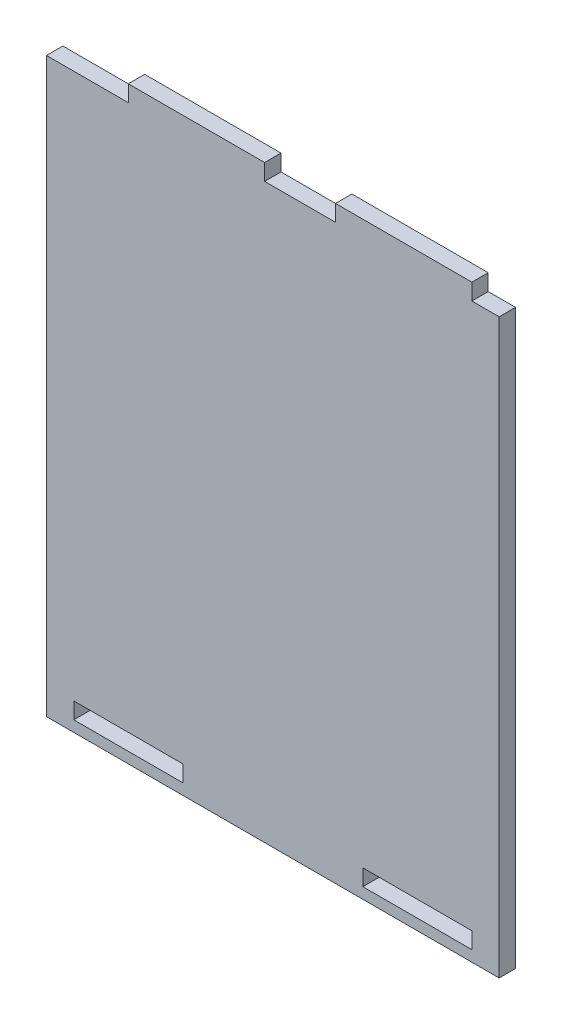
ISO-10303-21;
HEADER;
FILE_DESCRIPTION(('STEP AP214'),'2;1');
FILE_NAME('part.step','',(''),(''),'','','');
FILE_SCHEMA(('AUTOMOTIVE_DESIGN { 1 0 10303 214 1 1 1 1 }'));
ENDSEC;
DATA;
#1=APPLICATION_CONTEXT('core data for automotive mechanical design processes');
#2=APPLICATION_PROTOCOL_DEFINITION('international standard','automotive_design',2000,#1);
#3=PRODUCT_CONTEXT('',#1,'mechanical');
#4=PRODUCT('Part','Part','',(#3));
#5=PRODUCT_RELATED_PRODUCT_CATEGORY('part','',(#4));
#6=PRODUCT_DEFINITION_FORMATION('','',#4);
#7=PRODUCT_DEFINITION_CONTEXT('part definition',#1,'design');
#8=PRODUCT_DEFINITION('design','',#6,#7);
#9=PRODUCT_DEFINITION_SHAPE('','',#8);
#10=(LENGTH_UNIT() NAMED_UNIT(*) SI_UNIT(.MILLI.,.METRE.));
#11=(NAMED_UNIT(*) PLANE_ANGLE_UNIT() SI_UNIT($,.RADIAN.));
#12=(NAMED_UNIT(*) SI_UNIT($,.STERADIAN.) SOLID_ANGLE_UNIT());
#13=UNCERTAINTY_MEASURE_WITH_UNIT(LENGTH_MEASURE(1.E-05),#10,'distance_accuracy_value','');
#14=(GEOMETRIC_REPRESENTATION_CONTEXT(3) GLOBAL_UNCERTAINTY_ASSIGNED_CONTEXT((#13)) GLOBAL_UNIT_ASSIGNED_CONTEXT((#10,
#11,#12)) REPRESENTATION_CONTEXT('',''));
#15=CARTESIAN_POINT('',(0.,0.,0.));
#16=DIRECTION('',(0.,0.,1.));
#17=DIRECTION('',(1.,0.,0.));
#18=AXIS2_PLACEMENT_3D('',#15,#16,#17);
#19=CARTESIAN_POINT('',(-66.5140684926858,-62.4844720496894,3.));
#20=DIRECTION('',(1.,0.,0.));
#21=DIRECTION('',(0.,0.,-1.));
#22=AXIS2_PLACEMENT_3D('',#19,#20,#21);
#23=PLANE('',#22);
#24=DIRECTION('',(0.,-1.,0.));
#25=VECTOR('',#24,1.);
#26=CARTESIAN_POINT('',(-66.5140684926858,-62.4844720496894,0.));
#27=LINE('',#26,#25);
#28=CARTESIAN_POINT('',(-66.5140684926858,42.5155279503106,0.));
#29=VERTEX_POINT('',#28);
#30=CARTESIAN_POINT('',(-66.5140684926858,-62.4844720496894,0.));
#31=VERTEX_POINT('',#30);
#32=EDGE_CURVE('E231',#29,#31,#27,.T.);
#33=ORIENTED_EDGE('',*,*,#32,.T.);
#34=DIRECTION('',(0.,0.,-1.));
#35=VECTOR('',#34,1.);
#36=CARTESIAN_POINT('',(-66.5140684926858,-62.4844720496894,3.));
#37=LINE('',#36,#35);
#38=CARTESIAN_POINT('',(-66.5140684926858,-62.4844720496894,3.));
#39=VERTEX_POINT('',#38);
#40=EDGE_CURVE('E11',#39,#31,#37,.T.);
#41=ORIENTED_EDGE('',*,*,#40,.F.);
#42=DIRECTION('',(0.,-1.,0.));
#43=VECTOR('',#42,1.);
#44=CARTESIAN_POINT('',(-66.5140684926858,-62.4844720496894,3.));
#45=LINE('',#44,#43);
#46=CARTESIAN_POINT('',(-66.5140684926858,42.5155279503106,3.));
#47=VERTEX_POINT('',#46);
#48=EDGE_CURVE('E238',#47,#39,#45,.T.);
#49=ORIENTED_EDGE('',*,*,#48,.F.);
#50=DIRECTION('',(0.,0.,-1.));
#51=VECTOR('',#50,1.);
#52=CARTESIAN_POINT('',(-66.5140684926858,42.5155279503106,3.));
#53=LINE('',#52,#51);
#54=EDGE_CURVE('E264',#47,#29,#53,.T.);
#55=ORIENTED_EDGE('',*,*,#54,.T.);
#56=EDGE_LOOP('',(#33,#41,#49,#55));
#57=FACE_BOUND('',#56,.T.);
#58=ADVANCED_FACE('F33',(#57),#23,.F.);
#59=CARTESIAN_POINT('',(-66.5140684926858,-62.4844720496894,3.));
#60=DIRECTION('',(0.,1.,0.));
#61=DIRECTION('',(0.,0.,1.));
#62=AXIS2_PLACEMENT_3D('',#59,#60,#61);
#63=PLANE('',#62);
#64=DIRECTION('',(1.,0.,0.));
#65=VECTOR('',#64,1.);
#66=CARTESIAN_POINT('',(-66.5140684926858,-62.4844720496894,0.));
#67=LINE('',#66,#65);
#68=CARTESIAN_POINT('',(16.4859315073142,-62.4844720496894,0.));
#69=VERTEX_POINT('',#68);
#70=EDGE_CURVE('E267',#31,#69,#67,.T.);
#71=ORIENTED_EDGE('',*,*,#70,.T.);
#72=DIRECTION('',(0.,0.,-1.));
#73=VECTOR('',#72,1.);
#74=CARTESIAN_POINT('',(16.4859315073142,-62.4844720496894,3.));
#75=LINE('',#74,#73);
#76=CARTESIAN_POINT('',(16.4859315073142,-62.4844720496894,3.));
#77=VERTEX_POINT('',#76);
#78=EDGE_CURVE('E40',#77,#69,#75,.T.);
#79=ORIENTED_EDGE('',*,*,#78,.F.);
#80=DIRECTION('',(1.,0.,0.));
#81=VECTOR('',#80,1.);
#82=CARTESIAN_POINT('',(-66.5140684926858,-62.4844720496894,3.));
#83=LINE('',#82,#81);
#84=EDGE_CURVE('E241',#39,#77,#83,.T.);
#85=ORIENTED_EDGE('',*,*,#84,.F.);
#86=ORIENTED_EDGE('',*,*,#40,.T.);
#87=EDGE_LOOP('',(#71,#79,#85,#86));
#88=FACE_BOUND('',#87,.T.);
#89=ADVANCED_FACE('F343',(#88),#63,.F.);
#90=CARTESIAN_POINT('',(16.4859315073142,-62.4844720496894,3.));
#91=DIRECTION('',(-1.,0.,0.));
#92=DIRECTION('',(0.,-1.,0.));
#93=AXIS2_PLACEMENT_3D('',#90,#91,#92);
#94=PLANE('',#93);
#95=DIRECTION('',(0.,1.,0.));
#96=VECTOR('',#95,1.);
#97=CARTESIAN_POINT('',(16.4859315073142,-62.4844720496894,0.));
#98=LINE('',#97,#96);
#99=CARTESIAN_POINT('',(16.4859315073142,42.5155279503106,0.));
#100=VERTEX_POINT('',#99);
#101=EDGE_CURVE('E269',#69,#100,#98,.T.);
#102=ORIENTED_EDGE('',*,*,#101,.T.);
#103=DIRECTION('',(0.,0.,-1.));
#104=VECTOR('',#103,1.);
#105=CARTESIAN_POINT('',(16.4859315073142,42.5155279503106,3.));
#106=LINE('',#105,#104);
#107=CARTESIAN_POINT('',(16.4859315073142,42.5155279503106,3.));
#108=VERTEX_POINT('',#107);
#109=EDGE_CURVE('E314',#108,#100,#106,.T.);
#110=ORIENTED_EDGE('',*,*,#109,.F.);
#111=DIRECTION('',(0.,1.,0.));
#112=VECTOR('',#111,1.);
#113=CARTESIAN_POINT('',(16.4859315073142,-62.4844720496894,3.));
#114=LINE('',#113,#112);
#115=EDGE_CURVE('E244',#77,#108,#114,.T.);
#116=ORIENTED_EDGE('',*,*,#115,.F.);
#117=ORIENTED_EDGE('',*,*,#78,.T.);
#118=EDGE_LOOP('',(#102,#110,#116,#117));
#119=FACE_BOUND('',#118,.T.);
#120=ADVANCED_FACE('F321',(#119),#94,.F.);
#121=CARTESIAN_POINT('',(11.4859315073142,42.5155279503106,3.));
#122=DIRECTION('',(0.,-1.,0.));
#123=DIRECTION('',(1.,0.,0.));
#124=AXIS2_PLACEMENT_3D('',#121,#122,#123);
#125=PLANE('',#124);
#126=DIRECTION('',(-1.,0.,0.));
#127=VECTOR('',#126,1.);
#128=CARTESIAN_POINT('',(11.4859315073142,42.5155279503106,0.));
#129=LINE('',#128,#127);
#130=CARTESIAN_POINT('',(11.4859315073142,42.5155279503106,0.));
#131=VERTEX_POINT('',#130);
#132=EDGE_CURVE('E271',#100,#131,#129,.T.);
#133=ORIENTED_EDGE('',*,*,#132,.T.);
#134=DIRECTION('',(0.,0.,-1.));
#135=VECTOR('',#134,1.);
#136=CARTESIAN_POINT('',(11.4859315073142,42.5155279503106,3.));
#137=LINE('',#136,#135);
#138=CARTESIAN_POINT('',(11.4859315073142,42.5155279503106,3.));
#139=VERTEX_POINT('',#138);
#140=EDGE_CURVE('E311',#139,#131,#137,.T.);
#141=ORIENTED_EDGE('',*,*,#140,.F.);
#142=DIRECTION('',(-1.,0.,0.));
#143=VECTOR('',#142,1.);
#144=CARTESIAN_POINT('',(11.4859315073142,42.5155279503106,3.));
#145=LINE('',#144,#143);
#146=EDGE_CURVE('E246',#108,#139,#145,.T.);
#147=ORIENTED_EDGE('',*,*,#146,.F.);
#148=ORIENTED_EDGE('',*,*,#109,.T.);
#149=EDGE_LOOP('',(#133,#141,#147,#148));
#150=FACE_BOUND('',#149,.T.);
#151=ADVANCED_FACE('F332',(#150),#125,.F.);
#152=CARTESIAN_POINT('',(11.4859315073142,42.5155279503106,3.));
#153=DIRECTION('',(-1.,0.,0.));
#154=DIRECTION('',(0.,0.,1.));
#155=AXIS2_PLACEMENT_3D('',#152,#153,#154);
#156=PLANE('',#155);
#157=DIRECTION('',(0.,1.,0.));
#158=VECTOR('',#157,1.);
#159=CARTESIAN_POINT('',(11.4859315073142,42.5155279503106,0.));
#160=LINE('',#159,#158);
#161=CARTESIAN_POINT('',(11.4859315073142,45.5155279503106,0.));
#162=VERTEX_POINT('',#161);
#163=EDGE_CURVE('E273',#131,#162,#160,.T.);
#164=ORIENTED_EDGE('',*,*,#163,.T.);
#165=DIRECTION('',(0.,0.,-1.));
#166=VECTOR('',#165,1.);
#167=CARTESIAN_POINT('',(11.4859315073142,45.5155279503106,3.));
#168=LINE('',#167,#166);
#169=CARTESIAN_POINT('',(11.4859315073142,45.5155279503106,3.));
#170=VERTEX_POINT('',#169);
#171=EDGE_CURVE('E308',#170,#162,#168,.T.);
#172=ORIENTED_EDGE('',*,*,#171,.F.);
#173=DIRECTION('',(0.,1.,0.));
#174=VECTOR('',#173,1.);
#175=CARTESIAN_POINT('',(11.4859315073142,42.5155279503106,3.));
#176=LINE('',#175,#174);
#177=EDGE_CURVE('E248',#139,#170,#176,.T.);
#178=ORIENTED_EDGE('',*,*,#177,.F.);
#179=ORIENTED_EDGE('',*,*,#140,.T.);
#180=EDGE_LOOP('',(#164,#172,#178,#179));
#181=FACE_BOUND('',#180,.T.);
#182=ADVANCED_FACE('F336',(#181),#156,.F.);
#183=CARTESIAN_POINT('',(-13.5140684926858,45.5155279503106,3.));
#184=DIRECTION('',(0.,-1.,0.));
#185=DIRECTION('',(0.,0.,-1.));
#186=AXIS2_PLACEMENT_3D('',#183,#184,#185);
#187=PLANE('',#186);
#188=DIRECTION('',(-1.,0.,0.));
#189=VECTOR('',#188,1.);
#190=CARTESIAN_POINT('',(-13.5140684926858,45.5155279503106,0.));
#191=LINE('',#190,#189);
#192=CARTESIAN_POINT('',(-13.5140684926858,45.5155279503106,0.));
#193=VERTEX_POINT('',#192);
#194=EDGE_CURVE('E275',#162,#193,#191,.T.);
#195=ORIENTED_EDGE('',*,*,#194,.T.);
#196=DIRECTION('',(0.,0.,-1.));
#197=VECTOR('',#196,1.);
#198=CARTESIAN_POINT('',(-13.5140684926858,45.5155279503106,3.));
#199=LINE('',#198,#197);
#200=CARTESIAN_POINT('',(-13.5140684926858,45.5155279503106,3.));
#201=VERTEX_POINT('',#200);
#202=EDGE_CURVE('E305',#201,#193,#199,.T.);
#203=ORIENTED_EDGE('',*,*,#202,.F.);
#204=DIRECTION('',(-1.,0.,0.));
#205=VECTOR('',#204,1.);
#206=CARTESIAN_POINT('',(-13.5140684926858,45.5155279503106,3.));
#207=LINE('',#206,#205);
#208=EDGE_CURVE('E250',#170,#201,#207,.T.);
#209=ORIENTED_EDGE('',*,*,#208,.F.);
#210=ORIENTED_EDGE('',*,*,#171,.T.);
#211=EDGE_LOOP('',(#195,#203,#209,#210));
#212=FACE_BOUND('',#211,.T.);
#213=ADVANCED_FACE('F376',(#212),#187,.F.);
#214=CARTESIAN_POINT('',(-13.5140684926858,42.5155279503106,3.));
#215=DIRECTION('',(1.,0.,0.));
#216=DIRECTION('',(0.,0.,-1.));
#217=AXIS2_PLACEMENT_3D('',#214,#215,#216);
#218=PLANE('',#217);
#219=DIRECTION('',(0.,-1.,0.));
#220=VECTOR('',#219,1.);
#221=CARTESIAN_POINT('',(-13.5140684926858,42.5155279503106,0.));
#222=LINE('',#221,#220);
#223=CARTESIAN_POINT('',(-13.5140684926858,42.5155279503106,0.));
#224=VERTEX_POINT('',#223);
#225=EDGE_CURVE('E277',#193,#224,#222,.T.);
#226=ORIENTED_EDGE('',*,*,#225,.T.);
#227=DIRECTION('',(0.,0.,-1.));
#228=VECTOR('',#227,1.);
#229=CARTESIAN_POINT('',(-13.5140684926858,42.5155279503106,3.));
#230=LINE('',#229,#228);
#231=CARTESIAN_POINT('',(-13.5140684926858,42.5155279503106,3.));
#232=VERTEX_POINT('',#231);
#233=EDGE_CURVE('E302',#232,#224,#230,.T.);
#234=ORIENTED_EDGE('',*,*,#233,.F.);
#235=DIRECTION('',(0.,-1.,0.));
#236=VECTOR('',#235,1.);
#237=CARTESIAN_POINT('',(-13.5140684926858,42.5155279503106,3.));
#238=LINE('',#237,#236);
#239=EDGE_CURVE('E252',#201,#232,#238,.T.);
#240=ORIENTED_EDGE('',*,*,#239,.F.);
#241=ORIENTED_EDGE('',*,*,#202,.T.);
#242=EDGE_LOOP('',(#226,#234,#240,#241));
#243=FACE_BOUND('',#242,.T.);
#244=ADVANCED_FACE('F374',(#243),#218,.F.);
#245=CARTESIAN_POINT('',(-26.5140684926858,42.5155279503106,3.));
#246=DIRECTION('',(0.,-1.,0.));
#247=DIRECTION('',(0.,0.,-1.));
#248=AXIS2_PLACEMENT_3D('',#245,#246,#247);
#249=PLANE('',#248);
#250=DIRECTION('',(-1.,0.,0.));
#251=VECTOR('',#250,1.);
#252=CARTESIAN_POINT('',(-26.5140684926858,42.5155279503106,0.));
#253=LINE('',#252,#251);
#254=CARTESIAN_POINT('',(-26.5140684926858,42.5155279503106,0.));
#255=VERTEX_POINT('',#254);
#256=EDGE_CURVE('E279',#224,#255,#253,.T.);
#257=ORIENTED_EDGE('',*,*,#256,.T.);
#258=DIRECTION('',(0.,0.,-1.));
#259=VECTOR('',#258,1.);
#260=CARTESIAN_POINT('',(-26.5140684926858,42.5155279503106,3.));
#261=LINE('',#260,#259);
#262=CARTESIAN_POINT('',(-26.5140684926858,42.5155279503106,3.));
#263=VERTEX_POINT('',#262);
#264=EDGE_CURVE('E299',#263,#255,#261,.T.);
#265=ORIENTED_EDGE('',*,*,#264,.F.);
#266=DIRECTION('',(-1.,0.,0.));
#267=VECTOR('',#266,1.);
#268=CARTESIAN_POINT('',(-26.5140684926858,42.5155279503106,3.));
#269=LINE('',#268,#267);
#270=EDGE_CURVE('E254',#232,#263,#269,.T.);
#271=ORIENTED_EDGE('',*,*,#270,.F.);
#272=ORIENTED_EDGE('',*,*,#233,.T.);
#273=EDGE_LOOP('',(#257,#265,#271,#272));
#274=FACE_BOUND('',#273,.T.);
#275=ADVANCED_FACE('F370',(#274),#249,.F.);
#276=CARTESIAN_POINT('',(-26.5140684926858,42.5155279503106,3.));
#277=DIRECTION('',(-1.,0.,0.));
#278=DIRECTION('',(0.,0.,1.));
#279=AXIS2_PLACEMENT_3D('',#276,#277,#278);
#280=PLANE('',#279);
#281=DIRECTION('',(0.,1.,0.));
#282=VECTOR('',#281,1.);
#283=CARTESIAN_POINT('',(-26.5140684926858,42.5155279503106,0.));
#284=LINE('',#283,#282);
#285=CARTESIAN_POINT('',(-26.5140684926858,45.5155279503106,0.));
#286=VERTEX_POINT('',#285);
#287=EDGE_CURVE('E281',#255,#286,#284,.T.);
#288=ORIENTED_EDGE('',*,*,#287,.T.);
#289=DIRECTION('',(0.,0.,-1.));
#290=VECTOR('',#289,1.);
#291=CARTESIAN_POINT('',(-26.5140684926858,45.5155279503106,3.));
#292=LINE('',#291,#290);
#293=CARTESIAN_POINT('',(-26.5140684926858,45.5155279503106,3.));
#294=VERTEX_POINT('',#293);
#295=EDGE_CURVE('E296',#294,#286,#292,.T.);
#296=ORIENTED_EDGE('',*,*,#295,.F.);
#297=DIRECTION('',(0.,1.,0.));
#298=VECTOR('',#297,1.);
#299=CARTESIAN_POINT('',(-26.5140684926858,42.5155279503106,3.));
#300=LINE('',#299,#298);
#301=EDGE_CURVE('E256',#263,#294,#300,.T.);
#302=ORIENTED_EDGE('',*,*,#301,.F.);
#303=ORIENTED_EDGE('',*,*,#264,.T.);
#304=EDGE_LOOP('',(#288,#296,#302,#303));
#305=FACE_BOUND('',#304,.T.);
#306=ADVANCED_FACE('F365',(#305),#280,.F.);
#307=CARTESIAN_POINT('',(-51.5140684926858,45.5155279503106,3.));
#308=DIRECTION('',(0.,-1.,0.));
#309=DIRECTION('',(0.,0.,-1.));
#310=AXIS2_PLACEMENT_3D('',#307,#308,#309);
#311=PLANE('',#310);
#312=DIRECTION('',(-1.,0.,0.));
#313=VECTOR('',#312,1.);
#314=CARTESIAN_POINT('',(-51.5140684926858,45.5155279503106,0.));
#315=LINE('',#314,#313);
#316=CARTESIAN_POINT('',(-51.5140684926858,45.5155279503106,0.));
#317=VERTEX_POINT('',#316);
#318=EDGE_CURVE('E283',#286,#317,#315,.T.);
#319=ORIENTED_EDGE('',*,*,#318,.T.);
#320=DIRECTION('',(0.,0.,-1.));
#321=VECTOR('',#320,1.);
#322=CARTESIAN_POINT('',(-51.5140684926858,45.5155279503106,3.));
#323=LINE('',#322,#321);
#324=CARTESIAN_POINT('',(-51.5140684926858,45.5155279503106,3.));
#325=VERTEX_POINT('',#324);
#326=EDGE_CURVE('E293',#325,#317,#323,.T.);
#327=ORIENTED_EDGE('',*,*,#326,.F.);
#328=DIRECTION('',(-1.,0.,0.));
#329=VECTOR('',#328,1.);
#330=CARTESIAN_POINT('',(-51.5140684926858,45.5155279503106,3.));
#331=LINE('',#330,#329);
#332=EDGE_CURVE('E258',#294,#325,#331,.T.);
#333=ORIENTED_EDGE('',*,*,#332,.F.);
#334=ORIENTED_EDGE('',*,*,#295,.T.);
#335=EDGE_LOOP('',(#319,#327,#333,#334));
#336=FACE_BOUND('',#335,.T.);
#337=ADVANCED_FACE('F359',(#336),#311,.F.);
#338=CARTESIAN_POINT('',(-51.5140684926858,42.5155279503106,3.));
#339=DIRECTION('',(1.,0.,0.));
#340=DIRECTION('',(0.,0.,-1.));
#341=AXIS2_PLACEMENT_3D('',#338,#339,#340);
#342=PLANE('',#341);
#343=DIRECTION('',(0.,-1.,0.));
#344=VECTOR('',#343,1.);
#345=CARTESIAN_POINT('',(-51.5140684926858,42.5155279503106,0.));
#346=LINE('',#345,#344);
#347=CARTESIAN_POINT('',(-51.5140684926858,42.5155279503106,0.));
#348=VERTEX_POINT('',#347);
#349=EDGE_CURVE('E285',#317,#348,#346,.T.);
#350=ORIENTED_EDGE('',*,*,#349,.T.);
#351=DIRECTION('',(0.,0.,-1.));
#352=VECTOR('',#351,1.);
#353=CARTESIAN_POINT('',(-51.5140684926858,42.5155279503106,3.));
#354=LINE('',#353,#352);
#355=CARTESIAN_POINT('',(-51.5140684926858,42.5155279503106,3.));
#356=VERTEX_POINT('',#355);
#357=EDGE_CURVE('E290',#356,#348,#354,.T.);
#358=ORIENTED_EDGE('',*,*,#357,.F.);
#359=DIRECTION('',(0.,-1.,0.));
#360=VECTOR('',#359,1.);
#361=CARTESIAN_POINT('',(-51.5140684926858,42.5155279503106,3.));
#362=LINE('',#361,#360);
#363=EDGE_CURVE('E260',#325,#356,#362,.T.);
#364=ORIENTED_EDGE('',*,*,#363,.F.);
#365=ORIENTED_EDGE('',*,*,#326,.T.);
#366=EDGE_LOOP('',(#350,#358,#364,#365));
#367=FACE_BOUND('',#366,.T.);
#368=ADVANCED_FACE('F355',(#367),#342,.F.);
#369=CARTESIAN_POINT('',(-66.5140684926858,42.5155279503106,3.));
#370=DIRECTION('',(0.,-1.,0.));
#371=DIRECTION('',(1.,0.,0.));
#372=AXIS2_PLACEMENT_3D('',#369,#370,#371);
#373=PLANE('',#372);
#374=DIRECTION('',(-1.,0.,0.));
#375=VECTOR('',#374,1.);
#376=CARTESIAN_POINT('',(-66.5140684926858,42.5155279503106,0.));
#377=LINE('',#376,#375);
#378=EDGE_CURVE('E242',#348,#29,#377,.T.);
#379=ORIENTED_EDGE('',*,*,#378,.T.);
#380=ORIENTED_EDGE('',*,*,#54,.F.);
#381=DIRECTION('',(-1.,0.,0.));
#382=VECTOR('',#381,1.);
#383=CARTESIAN_POINT('',(-66.5140684926858,42.5155279503106,3.));
#384=LINE('',#383,#382);
#385=EDGE_CURVE('E262',#356,#47,#384,.T.);
#386=ORIENTED_EDGE('',*,*,#385,.F.);
#387=ORIENTED_EDGE('',*,*,#357,.T.);
#388=EDGE_LOOP('',(#379,#380,#386,#387));
#389=FACE_BOUND('',#388,.T.);
#390=ADVANCED_FACE('F350',(#389),#373,.F.);
#391=CARTESIAN_POINT('',(0.,0.,3.));
#392=DIRECTION('',(0.,0.,-1.));
#393=DIRECTION('',(-1.,0.,0.));
#394=AXIS2_PLACEMENT_3D('',#391,#392,#393);
#395=PLANE('',#394);
#396=DIRECTION('',(-1.,0.,0.));
#397=VECTOR('',#396,1.);
#398=CARTESIAN_POINT('',(-8.51406849268578,-60.4844720496894,3.));
#399=LINE('',#398,#397);
#400=CARTESIAN_POINT('',(11.4859315073142,-60.4844720496894,3.));
#401=VERTEX_POINT('',#400);
#402=CARTESIAN_POINT('',(-8.51406849268578,-60.4844720496894,3.));
#403=VERTEX_POINT('',#402);
#404=EDGE_CURVE('E177',#401,#403,#399,.T.);
#405=ORIENTED_EDGE('',*,*,#404,.T.);
#406=DIRECTION('',(0.,1.,0.));
#407=VECTOR('',#406,1.);
#408=CARTESIAN_POINT('',(-8.51406849268578,-57.4844720496894,3.));
#409=LINE('',#408,#407);
#410=CARTESIAN_POINT('',(-8.51406849268578,-57.4844720496894,3.));
#411=VERTEX_POINT('',#410);
#412=EDGE_CURVE('E171',#403,#411,#409,.T.);
#413=ORIENTED_EDGE('',*,*,#412,.T.);
#414=DIRECTION('',(1.,0.,0.));
#415=VECTOR('',#414,1.);
#416=CARTESIAN_POINT('',(-8.51406849268578,-57.4844720496894,3.));
#417=LINE('',#416,#415);
#418=CARTESIAN_POINT('',(11.4859315073142,-57.4844720496894,3.));
#419=VERTEX_POINT('',#418);
#420=EDGE_CURVE('E180',#411,#419,#417,.T.);
#421=ORIENTED_EDGE('',*,*,#420,.T.);
#422=DIRECTION('',(0.,-1.,0.));
#423=VECTOR('',#422,1.);
#424=CARTESIAN_POINT('',(11.4859315073142,-57.4844720496894,3.));
#425=LINE('',#424,#423);
#426=EDGE_CURVE('E47',#419,#401,#425,.T.);
#427=ORIENTED_EDGE('',*,*,#426,.T.);
#428=EDGE_LOOP('',(#405,#413,#421,#427));
#429=FACE_BOUND('',#428,.T.);
#430=DIRECTION('',(-1.,0.,0.));
#431=VECTOR('',#430,1.);
#432=CARTESIAN_POINT('',(-61.5140684926858,-60.4844720496894,3.));
#433=LINE('',#432,#431);
#434=CARTESIAN_POINT('',(-41.5140684926858,-60.4844720496894,3.));
#435=VERTEX_POINT('',#434);
#436=CARTESIAN_POINT('',(-61.5140684926858,-60.4844720496894,3.));
#437=VERTEX_POINT('',#436);
#438=EDGE_CURVE('E216',#435,#437,#433,.T.);
#439=ORIENTED_EDGE('',*,*,#438,.T.);
#440=DIRECTION('',(0.,1.,0.));
#441=VECTOR('',#440,1.);
#442=CARTESIAN_POINT('',(-61.5140684926858,-57.4844720496894,3.));
#443=LINE('',#442,#441);
#444=CARTESIAN_POINT('',(-61.5140684926858,-57.4844720496894,3.));
#445=VERTEX_POINT('',#444);
#446=EDGE_CURVE('E206',#437,#445,#443,.T.);
#447=ORIENTED_EDGE('',*,*,#446,.T.);
#448=DIRECTION('',(1.,0.,0.));
#449=VECTOR('',#448,1.);
#450=CARTESIAN_POINT('',(-61.5140684926858,-57.4844720496894,3.));
#451=LINE('',#450,#449);
#452=CARTESIAN_POINT('',(-41.5140684926858,-57.4844720496894,3.));
#453=VERTEX_POINT('',#452);
#454=EDGE_CURVE('E209',#445,#453,#451,.T.);
#455=ORIENTED_EDGE('',*,*,#454,.T.);
#456=DIRECTION('',(0.,-1.,0.));
#457=VECTOR('',#456,1.);
#458=CARTESIAN_POINT('',(-41.5140684926858,-57.4844720496894,3.));
#459=LINE('',#458,#457);
#460=EDGE_CURVE('E213',#453,#435,#459,.T.);
#461=ORIENTED_EDGE('',*,*,#460,.T.);
#462=EDGE_LOOP('',(#439,#447,#455,#461));
#463=FACE_BOUND('',#462,.T.);
#464=ORIENTED_EDGE('',*,*,#48,.T.);
#465=ORIENTED_EDGE('',*,*,#84,.T.);
#466=ORIENTED_EDGE('',*,*,#115,.T.);
#467=ORIENTED_EDGE('',*,*,#146,.T.);
#468=ORIENTED_EDGE('',*,*,#177,.T.);
#469=ORIENTED_EDGE('',*,*,#208,.T.);
#470=ORIENTED_EDGE('',*,*,#239,.T.);
#471=ORIENTED_EDGE('',*,*,#270,.T.);
#472=ORIENTED_EDGE('',*,*,#301,.T.);
#473=ORIENTED_EDGE('',*,*,#332,.T.);
#474=ORIENTED_EDGE('',*,*,#363,.T.);
#475=ORIENTED_EDGE('',*,*,#385,.T.);
#476=EDGE_LOOP('',(#464,#465,#466,#467,#468,#469,#470,#471,#472,#473,#474,#475));
#477=FACE_BOUND('',#476,.T.);
#478=ADVANCED_FACE('F184',(#429,#463,#477),#395,.F.);
#479=CARTESIAN_POINT('',(0.,0.,0.));
#480=DIRECTION('',(0.,0.,-1.));
#481=DIRECTION('',(-1.,0.,0.));
#482=AXIS2_PLACEMENT_3D('',#479,#480,#481);
#483=PLANE('',#482);
#484=DIRECTION('',(0.,1.,0.));
#485=VECTOR('',#484,1.);
#486=CARTESIAN_POINT('',(-8.51406849268578,-57.4844720496894,0.));
#487=LINE('',#486,#485);
#488=CARTESIAN_POINT('',(-8.51406849268578,-60.4844720496894,0.));
#489=VERTEX_POINT('',#488);
#490=CARTESIAN_POINT('',(-8.51406849268578,-57.4844720496894,0.));
#491=VERTEX_POINT('',#490);
#492=EDGE_CURVE('E55',#489,#491,#487,.T.);
#493=ORIENTED_EDGE('',*,*,#492,.F.);
#494=DIRECTION('',(-1.,0.,0.));
#495=VECTOR('',#494,1.);
#496=CARTESIAN_POINT('',(-8.51406849268578,-60.4844720496894,0.));
#497=LINE('',#496,#495);
#498=CARTESIAN_POINT('',(11.4859315073142,-60.4844720496894,0.));
#499=VERTEX_POINT('',#498);
#500=EDGE_CURVE('E187',#499,#489,#497,.T.);
#501=ORIENTED_EDGE('',*,*,#500,.F.);
#502=DIRECTION('',(0.,-1.,0.));
#503=VECTOR('',#502,1.);
#504=CARTESIAN_POINT('',(11.4859315073142,-57.4844720496894,0.));
#505=LINE('',#504,#503);
#506=CARTESIAN_POINT('',(11.4859315073142,-57.4844720496894,0.));
#507=VERTEX_POINT('',#506);
#508=EDGE_CURVE('E190',#507,#499,#505,.T.);
#509=ORIENTED_EDGE('',*,*,#508,.F.);
#510=DIRECTION('',(1.,0.,0.));
#511=VECTOR('',#510,1.);
#512=CARTESIAN_POINT('',(-8.51406849268578,-57.4844720496894,0.));
#513=LINE('',#512,#511);
#514=EDGE_CURVE('E196',#491,#507,#513,.T.);
#515=ORIENTED_EDGE('',*,*,#514,.F.);
#516=EDGE_LOOP('',(#493,#501,#509,#515));
#517=FACE_BOUND('',#516,.T.);
#518=DIRECTION('',(0.,1.,0.));
#519=VECTOR('',#518,1.);
#520=CARTESIAN_POINT('',(-61.5140684926858,-57.4844720496894,0.));
#521=LINE('',#520,#519);
#522=CARTESIAN_POINT('',(-61.5140684926858,-60.4844720496894,0.));
#523=VERTEX_POINT('',#522);
#524=CARTESIAN_POINT('',(-61.5140684926858,-57.4844720496894,0.));
#525=VERTEX_POINT('',#524);
#526=EDGE_CURVE('E202',#523,#525,#521,.T.);
#527=ORIENTED_EDGE('',*,*,#526,.F.);
#528=DIRECTION('',(-1.,0.,0.));
#529=VECTOR('',#528,1.);
#530=CARTESIAN_POINT('',(-61.5140684926858,-60.4844720496894,0.));
#531=LINE('',#530,#529);
#532=CARTESIAN_POINT('',(-41.5140684926858,-60.4844720496894,0.));
#533=VERTEX_POINT('',#532);
#534=EDGE_CURVE('E210',#533,#523,#531,.T.);
#535=ORIENTED_EDGE('',*,*,#534,.F.);
#536=DIRECTION('',(0.,-1.,0.));
#537=VECTOR('',#536,1.);
#538=CARTESIAN_POINT('',(-41.5140684926858,-57.4844720496894,0.));
#539=LINE('',#538,#537);
#540=CARTESIAN_POINT('',(-41.5140684926858,-57.4844720496894,0.));
#541=VERTEX_POINT('',#540);
#542=EDGE_CURVE('E224',#541,#533,#539,.T.);
#543=ORIENTED_EDGE('',*,*,#542,.F.);
#544=DIRECTION('',(1.,0.,0.));
#545=VECTOR('',#544,1.);
#546=CARTESIAN_POINT('',(-61.5140684926858,-57.4844720496894,0.));
#547=LINE('',#546,#545);
#548=EDGE_CURVE('E221',#525,#541,#547,.T.);
#549=ORIENTED_EDGE('',*,*,#548,.F.);
#550=EDGE_LOOP('',(#527,#535,#543,#549));
#551=FACE_BOUND('',#550,.T.);
#552=ORIENTED_EDGE('',*,*,#32,.F.);
#553=ORIENTED_EDGE('',*,*,#378,.F.);
#554=ORIENTED_EDGE('',*,*,#349,.F.);
#555=ORIENTED_EDGE('',*,*,#318,.F.);
#556=ORIENTED_EDGE('',*,*,#287,.F.);
#557=ORIENTED_EDGE('',*,*,#256,.F.);
#558=ORIENTED_EDGE('',*,*,#225,.F.);
#559=ORIENTED_EDGE('',*,*,#194,.F.);
#560=ORIENTED_EDGE('',*,*,#163,.F.);
#561=ORIENTED_EDGE('',*,*,#132,.F.);
#562=ORIENTED_EDGE('',*,*,#101,.F.);
#563=ORIENTED_EDGE('',*,*,#70,.F.);
#564=EDGE_LOOP('',(#552,#553,#554,#555,#556,#557,#558,#559,#560,#561,#562,#563));
#565=FACE_BOUND('',#564,.T.);
#566=ADVANCED_FACE('F327',(#517,#551,#565),#483,.T.);
#567=CARTESIAN_POINT('',(-61.5140684926858,-57.4844720496894,3.));
#568=DIRECTION('',(-1.,0.,0.));
#569=DIRECTION('',(0.,-1.,0.));
#570=AXIS2_PLACEMENT_3D('',#567,#568,#569);
#571=PLANE('',#570);
#572=ORIENTED_EDGE('',*,*,#526,.T.);
#573=DIRECTION('',(0.,0.,-1.));
#574=VECTOR('',#573,1.);
#575=CARTESIAN_POINT('',(-61.5140684926858,-57.4844720496894,3.));
#576=LINE('',#575,#574);
#577=EDGE_CURVE('E219',#445,#525,#576,.T.);
#578=ORIENTED_EDGE('',*,*,#577,.F.);
#579=ORIENTED_EDGE('',*,*,#446,.F.);
#580=DIRECTION('',(0.,0.,-1.));
#581=VECTOR('',#580,1.);
#582=CARTESIAN_POINT('',(-61.5140684926858,-60.4844720496894,3.));
#583=LINE('',#582,#581);
#584=EDGE_CURVE('E229',#437,#523,#583,.T.);
#585=ORIENTED_EDGE('',*,*,#584,.T.);
#586=EDGE_LOOP('',(#572,#578,#579,#585));
#587=FACE_BOUND('',#586,.T.);
#588=ADVANCED_FACE('F470',(#587),#571,.F.);
#589=CARTESIAN_POINT('',(-61.5140684926858,-60.4844720496894,3.));
#590=DIRECTION('',(0.,-1.,0.));
#591=DIRECTION('',(0.,0.,-1.));
#592=AXIS2_PLACEMENT_3D('',#589,#590,#591);
#593=PLANE('',#592);
#594=ORIENTED_EDGE('',*,*,#534,.T.);
#595=ORIENTED_EDGE('',*,*,#584,.F.);
#596=ORIENTED_EDGE('',*,*,#438,.F.);
#597=DIRECTION('',(0.,0.,-1.));
#598=VECTOR('',#597,1.);
#599=CARTESIAN_POINT('',(-41.5140684926858,-60.4844720496894,3.));
#600=LINE('',#599,#598);
#601=EDGE_CURVE('E232',#435,#533,#600,.T.);
#602=ORIENTED_EDGE('',*,*,#601,.T.);
#603=EDGE_LOOP('',(#594,#595,#596,#602));
#604=FACE_BOUND('',#603,.T.);
#605=ADVANCED_FACE('F480',(#604),#593,.F.);
#606=CARTESIAN_POINT('',(-41.5140684926858,-57.4844720496894,3.));
#607=DIRECTION('',(1.,0.,0.));
#608=DIRECTION('',(0.,0.,-1.));
#609=AXIS2_PLACEMENT_3D('',#606,#607,#608);
#610=PLANE('',#609);
#611=ORIENTED_EDGE('',*,*,#542,.T.);
#612=ORIENTED_EDGE('',*,*,#601,.F.);
#613=ORIENTED_EDGE('',*,*,#460,.F.);
#614=DIRECTION('',(0.,0.,-1.));
#615=VECTOR('',#614,1.);
#616=CARTESIAN_POINT('',(-41.5140684926858,-57.4844720496894,3.));
#617=LINE('',#616,#615);
#618=EDGE_CURVE('E234',#453,#541,#617,.T.);
#619=ORIENTED_EDGE('',*,*,#618,.T.);
#620=EDGE_LOOP('',(#611,#612,#613,#619));
#621=FACE_BOUND('',#620,.T.);
#622=ADVANCED_FACE('F490',(#621),#610,.F.);
#623=CARTESIAN_POINT('',(-61.5140684926858,-57.4844720496894,3.));
#624=DIRECTION('',(0.,1.,0.));
#625=DIRECTION('',(0.,0.,1.));
#626=AXIS2_PLACEMENT_3D('',#623,#624,#625);
#627=PLANE('',#626);
#628=ORIENTED_EDGE('',*,*,#548,.T.);
#629=ORIENTED_EDGE('',*,*,#618,.F.);
#630=ORIENTED_EDGE('',*,*,#454,.F.);
#631=ORIENTED_EDGE('',*,*,#577,.T.);
#632=EDGE_LOOP('',(#628,#629,#630,#631));
#633=FACE_BOUND('',#632,.T.);
#634=ADVANCED_FACE('F500',(#633),#627,.F.);
#635=CARTESIAN_POINT('',(-8.51406849268578,-57.4844720496894,3.));
#636=DIRECTION('',(-1.,0.,0.));
#637=DIRECTION('',(0.,0.,1.));
#638=AXIS2_PLACEMENT_3D('',#635,#636,#637);
#639=PLANE('',#638);
#640=ORIENTED_EDGE('',*,*,#492,.T.);
#641=DIRECTION('',(0.,0.,-1.));
#642=VECTOR('',#641,1.);
#643=CARTESIAN_POINT('',(-8.51406849268578,-57.4844720496894,3.));
#644=LINE('',#643,#642);
#645=EDGE_CURVE('E167',#411,#491,#644,.T.);
#646=ORIENTED_EDGE('',*,*,#645,.F.);
#647=ORIENTED_EDGE('',*,*,#412,.F.);
#648=DIRECTION('',(0.,0.,-1.));
#649=VECTOR('',#648,1.);
#650=CARTESIAN_POINT('',(-8.51406849268578,-60.4844720496894,3.));
#651=LINE('',#650,#649);
#652=EDGE_CURVE('E200',#403,#489,#651,.T.);
#653=ORIENTED_EDGE('',*,*,#652,.T.);
#654=EDGE_LOOP('',(#640,#646,#647,#653));
#655=FACE_BOUND('',#654,.T.);
#656=ADVANCED_FACE('F169',(#655),#639,.F.);
#657=CARTESIAN_POINT('',(-8.51406849268578,-60.4844720496894,3.));
#658=DIRECTION('',(0.,-1.,0.));
#659=DIRECTION('',(1.,0.,0.));
#660=AXIS2_PLACEMENT_3D('',#657,#658,#659);
#661=PLANE('',#660);
#662=ORIENTED_EDGE('',*,*,#500,.T.);
#663=ORIENTED_EDGE('',*,*,#652,.F.);
#664=ORIENTED_EDGE('',*,*,#404,.F.);
#665=DIRECTION('',(0.,0.,-1.));
#666=VECTOR('',#665,1.);
#667=CARTESIAN_POINT('',(11.4859315073142,-60.4844720496894,3.));
#668=LINE('',#667,#666);
#669=EDGE_CURVE('E203',#401,#499,#668,.T.);
#670=ORIENTED_EDGE('',*,*,#669,.T.);
#671=EDGE_LOOP('',(#662,#663,#664,#670));
#672=FACE_BOUND('',#671,.T.);
#673=ADVANCED_FACE('F519',(#672),#661,.F.);
#674=CARTESIAN_POINT('',(11.4859315073142,-57.4844720496894,3.));
#675=DIRECTION('',(1.,0.,0.));
#676=DIRECTION('',(0.,1.,0.));
#677=AXIS2_PLACEMENT_3D('',#674,#675,#676);
#678=PLANE('',#677);
#679=ORIENTED_EDGE('',*,*,#508,.T.);
#680=ORIENTED_EDGE('',*,*,#669,.F.);
#681=ORIENTED_EDGE('',*,*,#426,.F.);
#682=DIRECTION('',(0.,0.,-1.));
#683=VECTOR('',#682,1.);
#684=CARTESIAN_POINT('',(11.4859315073142,-57.4844720496894,3.));
#685=LINE('',#684,#683);
#686=EDGE_CURVE('E176',#419,#507,#685,.T.);
#687=ORIENTED_EDGE('',*,*,#686,.T.);
#688=EDGE_LOOP('',(#679,#680,#681,#687));
#689=FACE_BOUND('',#688,.T.);
#690=ADVANCED_FACE('F528',(#689),#678,.F.);
#691=CARTESIAN_POINT('',(-8.51406849268578,-57.4844720496894,3.));
#692=DIRECTION('',(0.,1.,0.));
#693=DIRECTION('',(-1.,0.,0.));
#694=AXIS2_PLACEMENT_3D('',#691,#692,#693);
#695=PLANE('',#694);
#696=ORIENTED_EDGE('',*,*,#514,.T.);
#697=ORIENTED_EDGE('',*,*,#686,.F.);
#698=ORIENTED_EDGE('',*,*,#420,.F.);
#699=ORIENTED_EDGE('',*,*,#645,.T.);
#700=EDGE_LOOP('',(#696,#697,#698,#699));
#701=FACE_BOUND('',#700,.T.);
#702=ADVANCED_FACE('F181',(#701),#695,.F.);
#703=CLOSED_SHELL('',(#58,#89,#120,#151,#182,#213,#244,#275,#306,#337,#368,#390,#478,#566,#588,
#605,#622,#634,#656,#673,#690,#702));
#704=MANIFOLD_SOLID_BREP('B2',#703);
#705=ADVANCED_BREP_SHAPE_REPRESENTATION('',(#18,#704),#14);
#706=SHAPE_DEFINITION_REPRESENTATION(#9,#705);
ENDSEC;
END-ISO-10303-21;
